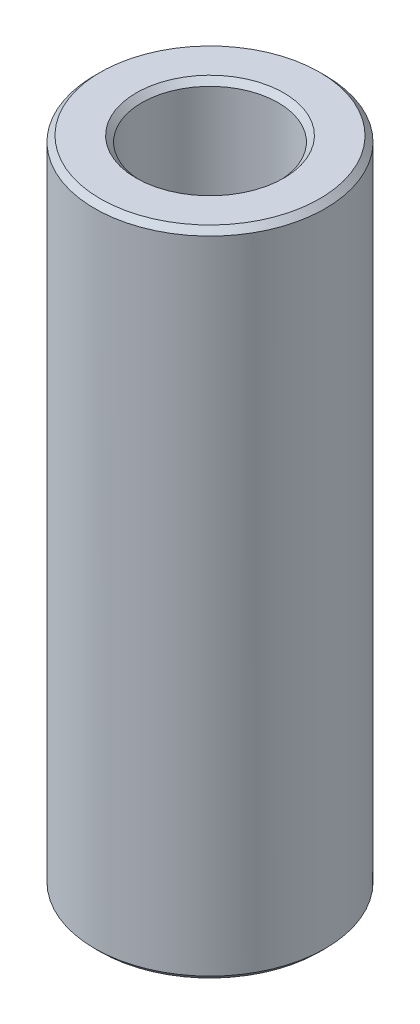
ISO-10303-21;
HEADER;
FILE_DESCRIPTION(('STEP AP214'),'2;1');
FILE_NAME('part.step','',(''),(''),'','','');
FILE_SCHEMA(('AUTOMOTIVE_DESIGN { 1 0 10303 214 1 1 1 1 }'));
ENDSEC;
DATA;
#1=APPLICATION_CONTEXT('core data for automotive mechanical design processes');
#2=APPLICATION_PROTOCOL_DEFINITION('international standard','automotive_design',2000,#1);
#3=PRODUCT_CONTEXT('',#1,'mechanical');
#4=PRODUCT('Part','Part','',(#3));
#5=PRODUCT_RELATED_PRODUCT_CATEGORY('part','',(#4));
#6=PRODUCT_DEFINITION_FORMATION('','',#4);
#7=PRODUCT_DEFINITION_CONTEXT('part definition',#1,'design');
#8=PRODUCT_DEFINITION('design','',#6,#7);
#9=PRODUCT_DEFINITION_SHAPE('','',#8);
#10=(LENGTH_UNIT() NAMED_UNIT(*) SI_UNIT(.MILLI.,.METRE.));
#11=(NAMED_UNIT(*) PLANE_ANGLE_UNIT() SI_UNIT($,.RADIAN.));
#12=(NAMED_UNIT(*) SI_UNIT($,.STERADIAN.) SOLID_ANGLE_UNIT());
#13=UNCERTAINTY_MEASURE_WITH_UNIT(LENGTH_MEASURE(1.E-05),#10,'distance_accuracy_value','');
#14=(GEOMETRIC_REPRESENTATION_CONTEXT(3) GLOBAL_UNCERTAINTY_ASSIGNED_CONTEXT((#13)) GLOBAL_UNIT_ASSIGNED_CONTEXT((#10,
#11,#12)) REPRESENTATION_CONTEXT('',''));
#15=CARTESIAN_POINT('',(0.,0.,0.));
#16=DIRECTION('',(0.,0.,1.));
#17=DIRECTION('',(1.,0.,0.));
#18=AXIS2_PLACEMENT_3D('',#15,#16,#17);
#19=CARTESIAN_POINT('',(0.,212.130577538564,0.));
#20=DIRECTION('',(0.,-1.,0.));
#21=DIRECTION('',(0.,0.,-1.));
#22=AXIS2_PLACEMENT_3D('',#19,#20,#21);
#23=CYLINDRICAL_SURFACE('',#22,37.5);
#24=CARTESIAN_POINT('',(0.,1.83633104393724,0.));
#25=DIRECTION('',(0.,1.,0.));
#26=DIRECTION('',(0.,0.,1.));
#27=AXIS2_PLACEMENT_3D('',#24,#25,#26);
#28=CIRCLE('',#27,37.5);
#29=CARTESIAN_POINT('',(0.,1.83633104393724,-37.5));
#30=VERTEX_POINT('',#29);
#31=EDGE_CURVE('E10',#30,#30,#28,.T.);
#32=CARTESIAN_POINT('',(0.,210.294246494627,0.));
#33=DIRECTION('',(0.,1.,0.));
#34=DIRECTION('',(0.,0.,1.));
#35=AXIS2_PLACEMENT_3D('',#32,#33,#34);
#36=CIRCLE('',#35,37.5);
#37=CARTESIAN_POINT('',(0.,210.294246494627,-37.5));
#38=VERTEX_POINT('',#37);
#39=EDGE_CURVE('E50',#38,#38,#36,.F.);
#40=CARTESIAN_POINT('',(0.,1.83633104393724,-37.5));
#41=CARTESIAN_POINT('',(0.,4.00776766321526,-37.5));
#42=CARTESIAN_POINT('',(0.,6.17920428249329,-37.5));
#43=CARTESIAN_POINT('',(0.,10.5220775210493,-37.5));
#44=CARTESIAN_POINT('',(0.,12.6935141403274,-37.5));
#45=CARTESIAN_POINT('',(0.,17.0363873788834,-37.5));
#46=CARTESIAN_POINT('',(0.,19.2078239981614,-37.5));
#47=CARTESIAN_POINT('',(0.,23.5506972367175,-37.5));
#48=CARTESIAN_POINT('',(0.,25.7221338559955,-37.5));
#49=CARTESIAN_POINT('',(0.,30.0650070945515,-37.5));
#50=CARTESIAN_POINT('',(0.,32.2364437138295,-37.5));
#51=CARTESIAN_POINT('',(0.,36.5793169523856,-37.5));
#52=CARTESIAN_POINT('',(0.,38.7507535716636,-37.5));
#53=CARTESIAN_POINT('',(0.,43.0936268102197,-37.5));
#54=CARTESIAN_POINT('',(0.,45.2650634294977,-37.5));
#55=CARTESIAN_POINT('',(0.,49.6079366680537,-37.5));
#56=CARTESIAN_POINT('',(0.,51.7793732873318,-37.5));
#57=CARTESIAN_POINT('',(0.,56.1222465258878,-37.5));
#58=CARTESIAN_POINT('',(0.,58.2936831451658,-37.5));
#59=CARTESIAN_POINT('',(0.,62.6365563837219,-37.5));
#60=CARTESIAN_POINT('',(0.,64.8079930029999,-37.5));
#61=CARTESIAN_POINT('',(0.,69.1508662415559,-37.5));
#62=CARTESIAN_POINT('',(0.,71.3223028608339,-37.5));
#63=CARTESIAN_POINT('',(0.,75.66517609939,-37.5));
#64=CARTESIAN_POINT('',(0.,77.836612718668,-37.5));
#65=CARTESIAN_POINT('',(0.,82.179485957224,-37.5));
#66=CARTESIAN_POINT('',(0.,84.3509225765021,-37.5));
#67=CARTESIAN_POINT('',(0.,88.6937958150581,-37.5));
#68=CARTESIAN_POINT('',(0.,90.8652324343361,-37.5));
#69=CARTESIAN_POINT('',(0.,95.2081056728922,-37.5));
#70=CARTESIAN_POINT('',(0.,97.3795422921702,-37.5));
#71=CARTESIAN_POINT('',(0.,101.722415530726,-37.5));
#72=CARTESIAN_POINT('',(0.,103.893852150004,-37.5));
#73=CARTESIAN_POINT('',(0.,108.23672538856,-37.5));
#74=CARTESIAN_POINT('',(0.,110.408162007838,-37.5));
#75=CARTESIAN_POINT('',(0.,114.751035246394,-37.5));
#76=CARTESIAN_POINT('',(0.,116.922471865672,-37.5));
#77=CARTESIAN_POINT('',(0.,121.265345104228,-37.5));
#78=CARTESIAN_POINT('',(0.,123.436781723506,-37.5));
#79=CARTESIAN_POINT('',(0.,127.779654962063,-37.5));
#80=CARTESIAN_POINT('',(0.,129.951091581341,-37.5));
#81=CARTESIAN_POINT('',(0.,134.293964819897,-37.5));
#82=CARTESIAN_POINT('',(0.,136.465401439175,-37.5));
#83=CARTESIAN_POINT('',(0.,140.808274677731,-37.5));
#84=CARTESIAN_POINT('',(0.,142.979711297009,-37.5));
#85=CARTESIAN_POINT('',(0.,147.322584535565,-37.5));
#86=CARTESIAN_POINT('',(0.,149.494021154843,-37.5));
#87=CARTESIAN_POINT('',(0.,153.836894393399,-37.5));
#88=CARTESIAN_POINT('',(0.,156.008331012677,-37.5));
#89=CARTESIAN_POINT('',(0.,160.351204251233,-37.5));
#90=CARTESIAN_POINT('',(0.,162.522640870511,-37.5));
#91=CARTESIAN_POINT('',(0.,166.865514109067,-37.5));
#92=CARTESIAN_POINT('',(0.,169.036950728345,-37.5));
#93=CARTESIAN_POINT('',(0.,173.379823966901,-37.5));
#94=CARTESIAN_POINT('',(0.,175.551260586179,-37.5));
#95=CARTESIAN_POINT('',(0.,179.894133824735,-37.5));
#96=CARTESIAN_POINT('',(0.,182.065570444013,-37.5));
#97=CARTESIAN_POINT('',(0.,186.408443682569,-37.5));
#98=CARTESIAN_POINT('',(0.,188.579880301847,-37.5));
#99=CARTESIAN_POINT('',(0.,192.922753540403,-37.5));
#100=CARTESIAN_POINT('',(0.,195.094190159681,-37.5));
#101=CARTESIAN_POINT('',(0.,199.437063398237,-37.5));
#102=CARTESIAN_POINT('',(0.,201.608500017515,-37.5));
#103=CARTESIAN_POINT('',(0.,205.951373256071,-37.5));
#104=CARTESIAN_POINT('',(0.,208.122809875349,-37.5));
#105=CARTESIAN_POINT('',(0.,210.294246494627,-37.5));
#106=B_SPLINE_CURVE_WITH_KNOTS('',3,(#40,#41,#42,#43,#44,#45,#46,#47,#48,#49,#50,#51,#52,#53,
#54,#55,#56,#57,#58,#59,#60,#61,#62,#63,#64,#65,#66,#67,#68,#69,#70,#71,#72,#73,#74,#75,#76,#77,
#78,#79,#80,#81,#82,#83,#84,#85,#86,#87,#88,#89,#90,#91,#92,#93,#94,#95,#96,#97,#98,#99,#100,
#101,#102,#103,#104,#105),.UNSPECIFIED.,.F.,.F.,(4,2,2,2,2,2,2,2,2,2,2,2,2,2,2,2,2,2,2,2,2,2,2,
2,2,2,2,2,2,2,2,2,4),(0.,6.51430985783408,13.0286197156681,19.5429295735022,26.0572394313363,
32.5715492891703,39.0858591470044,45.6001690048385,52.1144788626725,58.6287887205066,
65.1430985783407,71.6574084361747,78.1717182940088,84.6860281518428,91.2003380096769,
97.714647867511,104.228957725345,110.743267583179,117.257577441013,123.771887298847,
130.286197156681,136.800507014515,143.314816872349,149.829126730184,156.343436588018,
162.857746445852,169.372056303686,175.88636616152,182.400676019354,188.914985877188,
195.429295735022,201.943605592856,208.45791545069),.UNSPECIFIED.);
#107=EDGE_CURVE('BSEAM39',#30,#38,#106,.T.);
#108=ORIENTED_EDGE('',*,*,#31,.T.);
#109=ORIENTED_EDGE('',*,*,#39,.T.);
#110=ORIENTED_EDGE('',*,*,#107,.T.);
#111=ORIENTED_EDGE('',*,*,#107,.F.);
#112=EDGE_LOOP('',(#108,#110,#109,#111));
#113=FACE_BOUND('',#112,.T.);
#114=ADVANCED_FACE('F39',(#113),#23,.T.);
#115=CARTESIAN_POINT('',(0.,212.130577538564,0.));
#116=DIRECTION('',(0.,1.,0.));
#117=DIRECTION('',(0.,0.,1.));
#118=AXIS2_PLACEMENT_3D('',#115,#116,#117);
#119=PLANE('',#118);
#120=CARTESIAN_POINT('',(0.,212.130577538564,0.));
#121=DIRECTION('',(0.,1.,0.));
#122=DIRECTION('',(0.,0.,1.));
#123=AXIS2_PLACEMENT_3D('',#120,#121,#122);
#124=CIRCLE('',#123,24.0228399009292);
#125=CARTESIAN_POINT('',(0.,212.130577538564,24.0228399009292));
#126=VERTEX_POINT('',#125);
#127=EDGE_CURVE('E58',#126,#126,#124,.F.);
#128=ORIENTED_EDGE('',*,*,#127,.T.);
#129=EDGE_LOOP('',(#128));
#130=FACE_BOUND('',#129,.T.);
#131=CARTESIAN_POINT('',(0.,212.130577538564,0.));
#132=DIRECTION('',(0.,1.,0.));
#133=DIRECTION('',(0.,0.,1.));
#134=AXIS2_PLACEMENT_3D('',#131,#132,#133);
#135=CIRCLE('',#134,35.6636689560631);
#136=CARTESIAN_POINT('',(0.,212.130577538564,35.6636689560631));
#137=VERTEX_POINT('',#136);
#138=EDGE_CURVE('E61',#137,#137,#135,.T.);
#139=ORIENTED_EDGE('',*,*,#138,.T.);
#140=EDGE_LOOP('',(#139));
#141=FACE_BOUND('',#140,.T.);
#142=ADVANCED_FACE('F88',(#130,#141),#119,.T.);
#143=CARTESIAN_POINT('',(0.,0.,0.));
#144=DIRECTION('',(0.,1.,0.));
#145=DIRECTION('',(0.,0.,1.));
#146=AXIS2_PLACEMENT_3D('',#143,#144,#145);
#147=PLANE('',#146);
#148=CARTESIAN_POINT('',(0.,0.,0.));
#149=DIRECTION('',(0.,1.,0.));
#150=DIRECTION('',(0.,0.,1.));
#151=AXIS2_PLACEMENT_3D('',#148,#149,#150);
#152=CIRCLE('',#151,24.0228399009291);
#153=CARTESIAN_POINT('',(0.,0.,-24.0228399009291));
#154=VERTEX_POINT('',#153);
#155=EDGE_CURVE('E51',#154,#154,#152,.T.);
#156=ORIENTED_EDGE('',*,*,#155,.T.);
#157=EDGE_LOOP('',(#156));
#158=FACE_BOUND('',#157,.T.);
#159=CARTESIAN_POINT('',(0.,0.,0.));
#160=DIRECTION('',(0.,1.,0.));
#161=DIRECTION('',(0.,0.,1.));
#162=AXIS2_PLACEMENT_3D('',#159,#160,#161);
#163=CIRCLE('',#162,35.6636689560627);
#164=CARTESIAN_POINT('',(0.,0.,35.6636689560627));
#165=VERTEX_POINT('',#164);
#166=EDGE_CURVE('E54',#165,#165,#163,.F.);
#167=ORIENTED_EDGE('',*,*,#166,.T.);
#168=EDGE_LOOP('',(#167));
#169=FACE_BOUND('',#168,.T.);
#170=ADVANCED_FACE('F83',(#158,#169),#147,.F.);
#171=CARTESIAN_POINT('',(0.,212.130577538564,0.));
#172=DIRECTION('',(0.,-1.,0.));
#173=DIRECTION('',(0.,0.,-1.));
#174=AXIS2_PLACEMENT_3D('',#171,#172,#173);
#175=CYLINDRICAL_SURFACE('',#174,22.186508856992);
#176=CARTESIAN_POINT('',(0.,210.294246494627,0.));
#177=DIRECTION('',(0.,1.,0.));
#178=DIRECTION('',(0.,0.,1.));
#179=AXIS2_PLACEMENT_3D('',#176,#177,#178);
#180=CIRCLE('',#179,22.186508856992);
#181=CARTESIAN_POINT('',(0.,210.294246494627,-22.186508856992));
#182=VERTEX_POINT('',#181);
#183=EDGE_CURVE('E67',#182,#182,#180,.T.);
#184=CARTESIAN_POINT('',(0.,1.83633104393713,0.));
#185=DIRECTION('',(0.,1.,0.));
#186=DIRECTION('',(0.,0.,1.));
#187=AXIS2_PLACEMENT_3D('',#184,#185,#186);
#188=CIRCLE('',#187,22.186508856992);
#189=CARTESIAN_POINT('',(0.,1.83633104393713,-22.186508856992));
#190=VERTEX_POINT('',#189);
#191=EDGE_CURVE('E69',#190,#190,#188,.F.);
#192=CARTESIAN_POINT('',(0.,210.294246494627,-22.186508856992));
#193=CARTESIAN_POINT('',(0.,208.122809875349,-22.186508856992));
#194=CARTESIAN_POINT('',(0.,205.951373256071,-22.186508856992));
#195=CARTESIAN_POINT('',(0.,201.608500017515,-22.186508856992));
#196=CARTESIAN_POINT('',(0.,199.437063398237,-22.186508856992));
#197=CARTESIAN_POINT('',(0.,195.094190159681,-22.186508856992));
#198=CARTESIAN_POINT('',(0.,192.922753540403,-22.186508856992));
#199=CARTESIAN_POINT('',(0.,188.579880301847,-22.186508856992));
#200=CARTESIAN_POINT('',(0.,186.408443682569,-22.186508856992));
#201=CARTESIAN_POINT('',(0.,182.065570444013,-22.186508856992));
#202=CARTESIAN_POINT('',(0.,179.894133824735,-22.186508856992));
#203=CARTESIAN_POINT('',(0.,175.551260586179,-22.186508856992));
#204=CARTESIAN_POINT('',(0.,173.379823966901,-22.186508856992));
#205=CARTESIAN_POINT('',(0.,169.036950728345,-22.186508856992));
#206=CARTESIAN_POINT('',(0.,166.865514109067,-22.186508856992));
#207=CARTESIAN_POINT('',(0.,162.522640870511,-22.186508856992));
#208=CARTESIAN_POINT('',(0.,160.351204251233,-22.186508856992));
#209=CARTESIAN_POINT('',(0.,156.008331012677,-22.186508856992));
#210=CARTESIAN_POINT('',(0.,153.836894393399,-22.186508856992));
#211=CARTESIAN_POINT('',(0.,149.494021154842,-22.186508856992));
#212=CARTESIAN_POINT('',(0.,147.322584535564,-22.186508856992));
#213=CARTESIAN_POINT('',(0.,142.979711297008,-22.186508856992));
#214=CARTESIAN_POINT('',(0.,140.80827467773,-22.186508856992));
#215=CARTESIAN_POINT('',(0.,136.465401439174,-22.186508856992));
#216=CARTESIAN_POINT('',(0.,134.293964819896,-22.186508856992));
#217=CARTESIAN_POINT('',(0.,129.95109158134,-22.186508856992));
#218=CARTESIAN_POINT('',(0.,127.779654962062,-22.186508856992));
#219=CARTESIAN_POINT('',(0.,123.436781723506,-22.186508856992));
#220=CARTESIAN_POINT('',(0.,121.265345104228,-22.186508856992));
#221=CARTESIAN_POINT('',(0.,116.922471865672,-22.186508856992));
#222=CARTESIAN_POINT('',(0.,114.751035246394,-22.186508856992));
#223=CARTESIAN_POINT('',(0.,110.408162007838,-22.186508856992));
#224=CARTESIAN_POINT('',(0.,108.23672538856,-22.186508856992));
#225=CARTESIAN_POINT('',(0.,103.893852150004,-22.186508856992));
#226=CARTESIAN_POINT('',(0.,101.722415530726,-22.186508856992));
#227=CARTESIAN_POINT('',(0.,97.37954229217,-22.186508856992));
#228=CARTESIAN_POINT('',(0.,95.208105672892,-22.186508856992));
#229=CARTESIAN_POINT('',(0.,90.865232434336,-22.186508856992));
#230=CARTESIAN_POINT('',(0.,88.6937958150579,-22.186508856992));
#231=CARTESIAN_POINT('',(0.,84.3509225765019,-22.186508856992));
#232=CARTESIAN_POINT('',(0.,82.1794859572239,-22.186508856992));
#233=CARTESIAN_POINT('',(0.,77.8366127186678,-22.186508856992));
#234=CARTESIAN_POINT('',(0.,75.6651760993898,-22.186508856992));
#235=CARTESIAN_POINT('',(0.,71.3223028608338,-22.186508856992));
#236=CARTESIAN_POINT('',(0.,69.1508662415558,-22.186508856992));
#237=CARTESIAN_POINT('',(0.,64.8079930029997,-22.186508856992));
#238=CARTESIAN_POINT('',(0.,62.6365563837217,-22.186508856992));
#239=CARTESIAN_POINT('',(0.,58.2936831451657,-22.186508856992));
#240=CARTESIAN_POINT('',(0.,56.1222465258876,-22.186508856992));
#241=CARTESIAN_POINT('',(0.,51.7793732873316,-22.186508856992));
#242=CARTESIAN_POINT('',(0.,49.6079366680536,-22.186508856992));
#243=CARTESIAN_POINT('',(0.,45.2650634294975,-22.186508856992));
#244=CARTESIAN_POINT('',(0.,43.0936268102195,-22.186508856992));
#245=CARTESIAN_POINT('',(0.,38.7507535716635,-22.186508856992));
#246=CARTESIAN_POINT('',(0.,36.5793169523855,-22.186508856992));
#247=CARTESIAN_POINT('',(0.,32.2364437138294,-22.186508856992));
#248=CARTESIAN_POINT('',(0.,30.0650070945514,-22.186508856992));
#249=CARTESIAN_POINT('',(0.,25.7221338559954,-22.186508856992));
#250=CARTESIAN_POINT('',(0.,23.5506972367173,-22.186508856992));
#251=CARTESIAN_POINT('',(0.,19.2078239981613,-22.186508856992));
#252=CARTESIAN_POINT('',(0.,17.0363873788833,-22.186508856992));
#253=CARTESIAN_POINT('',(0.,12.6935141403273,-22.186508856992));
#254=CARTESIAN_POINT('',(0.,10.5220775210492,-22.186508856992));
#255=CARTESIAN_POINT('',(0.,6.17920428249318,-22.186508856992));
#256=CARTESIAN_POINT('',(0.,4.00776766321516,-22.186508856992));
#257=CARTESIAN_POINT('',(0.,1.83633104393713,-22.186508856992));
#258=B_SPLINE_CURVE_WITH_KNOTS('',3,(#192,#193,#194,#195,#196,#197,#198,#199,#200,#201,#202,
#203,#204,#205,#206,#207,#208,#209,#210,#211,#212,#213,#214,#215,#216,#217,#218,#219,#220,#221,
#222,#223,#224,#225,#226,#227,#228,#229,#230,#231,#232,#233,#234,#235,#236,#237,#238,#239,#240,
#241,#242,#243,#244,#245,#246,#247,#248,#249,#250,#251,#252,#253,#254,#255,#256,#257),
.UNSPECIFIED.,.F.,.F.,(4,2,2,2,2,2,2,2,2,2,2,2,2,2,2,2,2,2,2,2,2,2,2,2,2,2,2,2,2,2,2,2,4),(0.,
6.51430985783408,13.0286197156681,19.5429295735022,26.0572394313363,32.5715492891703,
39.0858591470044,45.6001690048384,52.1144788626725,58.6287887205066,65.1430985783406,
71.6574084361747,78.1717182940087,84.6860281518428,91.2003380096768,97.7146478675109,
104.228957725345,110.743267583179,117.257577441013,123.771887298847,130.286197156681,
136.800507014515,143.314816872349,149.829126730183,156.343436588017,162.857746445851,
169.372056303686,175.88636616152,182.400676019354,188.914985877188,195.429295735022,
201.943605592856,208.45791545069),.UNSPECIFIED.);
#259=EDGE_CURVE('BSEAM71',#182,#190,#258,.T.);
#260=ORIENTED_EDGE('',*,*,#183,.T.);
#261=ORIENTED_EDGE('',*,*,#191,.T.);
#262=ORIENTED_EDGE('',*,*,#259,.T.);
#263=ORIENTED_EDGE('',*,*,#259,.F.);
#264=EDGE_LOOP('',(#260,#262,#261,#263));
#265=FACE_BOUND('',#264,.T.);
#266=ADVANCED_FACE('F71',(#265),#175,.F.);
#267=CARTESIAN_POINT('',(0.,210.294246494627,0.));
#268=DIRECTION('',(0.,1.,0.));
#269=DIRECTION('',(0.,0.,1.));
#270=AXIS2_PLACEMENT_3D('',#267,#268,#269);
#271=CONICAL_SURFACE('',#270,22.186508856992,0.785398163397451);
#272=ORIENTED_EDGE('',*,*,#127,.F.);
#273=EDGE_LOOP('',(#272));
#274=FACE_BOUND('',#273,.T.);
#275=ORIENTED_EDGE('',*,*,#183,.F.);
#276=EDGE_LOOP('',(#275));
#277=FACE_BOUND('',#276,.T.);
#278=ADVANCED_FACE('F77',(#274,#277),#271,.F.);
#279=CARTESIAN_POINT('',(0.,0.,0.));
#280=DIRECTION('',(0.,-1.,0.));
#281=DIRECTION('',(0.,0.,-1.));
#282=AXIS2_PLACEMENT_3D('',#279,#280,#281);
#283=CONICAL_SURFACE('',#282,24.0228399009291,0.785398163397443);
#284=CARTESIAN_POINT('',(0.,1.83633104393713,-22.186508856992));
#285=CARTESIAN_POINT('',(0.,1.81720259556278,-22.2056373053663));
#286=CARTESIAN_POINT('',(0.,1.79807414718844,-22.2247657537407));
#287=CARTESIAN_POINT('',(0.,1.75981725043975,-22.2630226504894));
#288=CARTESIAN_POINT('',(0.,1.7406888020654,-22.2821510988637));
#289=CARTESIAN_POINT('',(0.,1.70243190531671,-22.3204079956124));
#290=CARTESIAN_POINT('',(0.,1.68330345694237,-22.3395364439867));
#291=CARTESIAN_POINT('',(0.,1.64504656019368,-22.3777933407354));
#292=CARTESIAN_POINT('',(0.,1.62591811181933,-22.3969217891098));
#293=CARTESIAN_POINT('',(0.,1.58766121507064,-22.4351786858585));
#294=CARTESIAN_POINT('',(0.,1.5685327666963,-22.4543071342328));
#295=CARTESIAN_POINT('',(0.,1.53027586994761,-22.4925640309815));
#296=CARTESIAN_POINT('',(0.,1.51114742157326,-22.5116924793559));
#297=CARTESIAN_POINT('',(0.,1.47289052482457,-22.5499493761045));
#298=CARTESIAN_POINT('',(0.,1.45376207645023,-22.5690778244789));
#299=CARTESIAN_POINT('',(0.,1.41550517970154,-22.6073347212276));
#300=CARTESIAN_POINT('',(0.,1.39637673132719,-22.6264631696019));
#301=CARTESIAN_POINT('',(0.,1.3581198345785,-22.6647200663506));
#302=CARTESIAN_POINT('',(0.,1.33899138620416,-22.683848514725));
#303=CARTESIAN_POINT('',(0.,1.30073448945547,-22.7221054114736));
#304=CARTESIAN_POINT('',(0.,1.28160604108112,-22.741233859848));
#305=CARTESIAN_POINT('',(0.,1.24334914433243,-22.7794907565967));
#306=CARTESIAN_POINT('',(0.,1.22422069595809,-22.798619204971));
#307=CARTESIAN_POINT('',(0.,1.1859637992094,-22.8368761017197));
#308=CARTESIAN_POINT('',(0.,1.16683535083505,-22.8560045500941));
#309=CARTESIAN_POINT('',(0.,1.12857845408636,-22.8942614468427));
#310=CARTESIAN_POINT('',(0.,1.10945000571201,-22.9133898952171));
#311=CARTESIAN_POINT('',(0.,1.07119310896332,-22.9516467919658));
#312=CARTESIAN_POINT('',(0.,1.05206466058898,-22.9707752403401));
#313=CARTESIAN_POINT('',(0.,1.01380776384029,-23.0090321370888));
#314=CARTESIAN_POINT('',(0.,0.994679315465944,-23.0281605854632));
#315=CARTESIAN_POINT('',(0.,0.956422418717254,-23.0664174822119));
#316=CARTESIAN_POINT('',(0.,0.937293970342909,-23.0855459305862));
#317=CARTESIAN_POINT('',(0.,0.899037073594219,-23.1238028273349));
#318=CARTESIAN_POINT('',(0.,0.879908625219874,-23.1429312757092));
#319=CARTESIAN_POINT('',(0.,0.841651728471184,-23.1811881724579));
#320=CARTESIAN_POINT('',(0.,0.822523280096839,-23.2003166208323));
#321=CARTESIAN_POINT('',(0.,0.784266383348148,-23.238573517581));
#322=CARTESIAN_POINT('',(0.,0.765137934973803,-23.2577019659553));
#323=CARTESIAN_POINT('',(0.,0.726881038225113,-23.295958862704));
#324=CARTESIAN_POINT('',(0.,0.707752589850768,-23.3150873110783));
#325=CARTESIAN_POINT('',(0.,0.669495693102078,-23.353344207827));
#326=CARTESIAN_POINT('',(0.,0.650367244727733,-23.3724726562014));
#327=CARTESIAN_POINT('',(0.,0.612110347979043,-23.4107295529501));
#328=CARTESIAN_POINT('',(0.,0.592981899604698,-23.4298580013244));
#329=CARTESIAN_POINT('',(0.,0.554725002856007,-23.4681148980731));
#330=CARTESIAN_POINT('',(0.,0.535596554481662,-23.4872433464474));
#331=CARTESIAN_POINT('',(0.,0.497339657732972,-23.5255002431961));
#332=CARTESIAN_POINT('',(0.,0.478211209358627,-23.5446286915705));
#333=CARTESIAN_POINT('',(0.,0.439954312609937,-23.5828855883192));
#334=CARTESIAN_POINT('',(0.,0.420825864235592,-23.6020140366935));
#335=CARTESIAN_POINT('',(0.,0.382568967486902,-23.6402709334422));
#336=CARTESIAN_POINT('',(0.,0.363440519112557,-23.6593993818165));
#337=CARTESIAN_POINT('',(0.,0.325183622363866,-23.6976562785652));
#338=CARTESIAN_POINT('',(0.,0.306055173989521,-23.7167847269396));
#339=CARTESIAN_POINT('',(0.,0.267798277240831,-23.7550416236883));
#340=CARTESIAN_POINT('',(0.,0.248669828866486,-23.7741700720626));
#341=CARTESIAN_POINT('',(0.,0.210412932117796,-23.8124269688113));
#342=CARTESIAN_POINT('',(0.,0.191284483743451,-23.8315554171856));
#343=CARTESIAN_POINT('',(0.,0.153027586994761,-23.8698123139343));
#344=CARTESIAN_POINT('',(0.,0.133899138620416,-23.8889407623087));
#345=CARTESIAN_POINT('',(0.,0.0956422418717254,-23.9271976590574));
#346=CARTESIAN_POINT('',(0.,0.0765137934973803,-23.9463261074317));
#347=CARTESIAN_POINT('',(0.,0.0382568967486902,-23.9845830041804));
#348=CARTESIAN_POINT('',(0.,0.0191284483743451,-24.0037114525548));
#349=CARTESIAN_POINT('',(0.,0.,-24.0228399009291));
#350=B_SPLINE_CURVE_WITH_KNOTS('',3,(#284,#285,#286,#287,#288,#289,#290,#291,#292,#293,#294,
#295,#296,#297,#298,#299,#300,#301,#302,#303,#304,#305,#306,#307,#308,#309,#310,#311,#312,#313,
#314,#315,#316,#317,#318,#319,#320,#321,#322,#323,#324,#325,#326,#327,#328,#329,#330,#331,#332,
#333,#334,#335,#336,#337,#338,#339,#340,#341,#342,#343,#344,#345,#346,#347,#348,#349),
.UNSPECIFIED.,.F.,.F.,(4,2,2,2,2,2,2,2,2,2,2,2,2,2,2,2,2,2,2,2,2,2,2,2,2,2,2,2,2,2,2,2,4),(0.,
0.0811551333544566,0.162310266708913,0.24346540006337,0.324620533417826,0.405775666772283,
0.48693080012674,0.568085933481196,0.649241066835655,0.730396200190112,0.811551333544568,
0.892706466899025,0.973861600253481,1.05501673360794,1.13617186696239,1.21732700031685,
1.29848213367131,1.37963726702576,1.46079240038022,1.54194753373468,1.62310266708913,
1.70425780044359,1.78541293379805,1.8665680671525,1.94772320050696,2.02887833386142,
2.11003346721588,2.19118860057033,2.27234373392479,2.35349886727925,2.4346540006337,
2.51580913398816,2.59696426734262),.UNSPECIFIED.);
#351=EDGE_CURVE('BSEAM73',#190,#154,#350,.T.);
#352=ORIENTED_EDGE('',*,*,#191,.F.);
#353=ORIENTED_EDGE('',*,*,#155,.F.);
#354=ORIENTED_EDGE('',*,*,#351,.T.);
#355=ORIENTED_EDGE('',*,*,#351,.F.);
#356=EDGE_LOOP('',(#352,#354,#353,#355));
#357=FACE_BOUND('',#356,.T.);
#358=ADVANCED_FACE('F73',(#357),#283,.F.);
#359=CARTESIAN_POINT('',(0.,1.83633104393724,0.));
#360=DIRECTION('',(0.,1.,0.));
#361=DIRECTION('',(0.,0.,1.));
#362=AXIS2_PLACEMENT_3D('',#359,#360,#361);
#363=CONICAL_SURFACE('',#362,37.5,0.785398163397458);
#364=ORIENTED_EDGE('',*,*,#166,.F.);
#365=EDGE_LOOP('',(#364));
#366=FACE_BOUND('',#365,.T.);
#367=ORIENTED_EDGE('',*,*,#31,.F.);
#368=EDGE_LOOP('',(#367));
#369=FACE_BOUND('',#368,.T.);
#370=ADVANCED_FACE('F76',(#366,#369),#363,.T.);
#371=CARTESIAN_POINT('',(0.,212.130577538564,0.));
#372=DIRECTION('',(0.,-1.,0.));
#373=DIRECTION('',(0.,0.,-1.));
#374=AXIS2_PLACEMENT_3D('',#371,#372,#373);
#375=CONICAL_SURFACE('',#374,35.6636689560631,0.78539816339745);
#376=ORIENTED_EDGE('',*,*,#39,.F.);
#377=EDGE_LOOP('',(#376));
#378=FACE_BOUND('',#377,.T.);
#379=ORIENTED_EDGE('',*,*,#138,.F.);
#380=EDGE_LOOP('',(#379));
#381=FACE_BOUND('',#380,.T.);
#382=ADVANCED_FACE('F45',(#378,#381),#375,.T.);
#383=CLOSED_SHELL('',(#114,#142,#170,#266,#278,#358,#370,#382));
#384=MANIFOLD_SOLID_BREP('B2',#383);
#385=ADVANCED_BREP_SHAPE_REPRESENTATION('',(#18,#384),#14);
#386=SHAPE_DEFINITION_REPRESENTATION(#9,#385);
ENDSEC;
END-ISO-10303-21;
